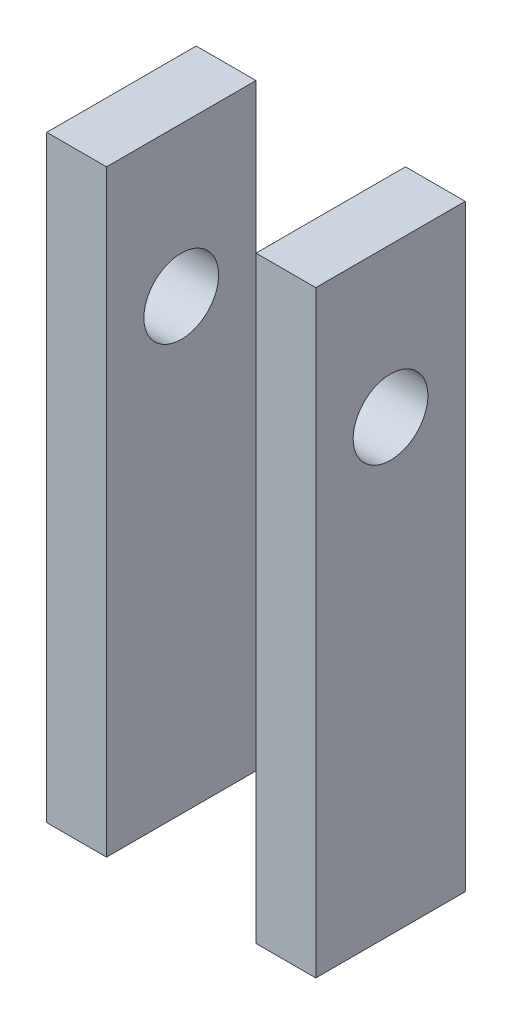
ISO-10303-21;
HEADER;
FILE_DESCRIPTION(('STEP AP214'),'2;1');
FILE_NAME('part.step','',(''),(''),'','','');
FILE_SCHEMA(('AUTOMOTIVE_DESIGN { 1 0 10303 214 1 1 1 1 }'));
ENDSEC;
DATA;
#1=APPLICATION_CONTEXT('core data for automotive mechanical design processes');
#2=APPLICATION_PROTOCOL_DEFINITION('international standard','automotive_design',2000,#1);
#3=PRODUCT_CONTEXT('',#1,'mechanical');
#4=PRODUCT('Part','Part','',(#3));
#5=PRODUCT_RELATED_PRODUCT_CATEGORY('part','',(#4));
#6=PRODUCT_DEFINITION_FORMATION('','',#4);
#7=PRODUCT_DEFINITION_CONTEXT('part definition',#1,'design');
#8=PRODUCT_DEFINITION('design','',#6,#7);
#9=PRODUCT_DEFINITION_SHAPE('','',#8);
#10=(LENGTH_UNIT() NAMED_UNIT(*) SI_UNIT(.MILLI.,.METRE.));
#11=(NAMED_UNIT(*) PLANE_ANGLE_UNIT() SI_UNIT($,.RADIAN.));
#12=(NAMED_UNIT(*) SI_UNIT($,.STERADIAN.) SOLID_ANGLE_UNIT());
#13=UNCERTAINTY_MEASURE_WITH_UNIT(LENGTH_MEASURE(1.E-05),#10,'distance_accuracy_value','');
#14=(GEOMETRIC_REPRESENTATION_CONTEXT(3) GLOBAL_UNCERTAINTY_ASSIGNED_CONTEXT((#13)) GLOBAL_UNIT_ASSIGNED_CONTEXT((#10,
#11,#12)) REPRESENTATION_CONTEXT('',''));
#15=CARTESIAN_POINT('',(0.,0.,0.));
#16=DIRECTION('',(0.,0.,1.));
#17=DIRECTION('',(1.,0.,0.));
#18=AXIS2_PLACEMENT_3D('',#15,#16,#17);
#19=CARTESIAN_POINT('',(6.35,50.8,0.));
#20=DIRECTION('',(-1.,0.,0.));
#21=DIRECTION('',(0.,0.,1.));
#22=AXIS2_PLACEMENT_3D('',#19,#20,#21);
#23=PLANE('',#22);
#24=CARTESIAN_POINT('',(6.35,38.1,0.));
#25=DIRECTION('',(-1.,0.,0.));
#26=DIRECTION('',(0.,0.,1.));
#27=AXIS2_PLACEMENT_3D('',#24,#25,#26);
#28=CIRCLE('',#27,3.175);
#29=CARTESIAN_POINT('',(6.35,38.1,3.175));
#30=VERTEX_POINT('',#29);
#31=EDGE_CURVE('E118',#30,#30,#28,.T.);
#32=ORIENTED_EDGE('',*,*,#31,.F.);
#33=EDGE_LOOP('',(#32));
#34=FACE_BOUND('',#33,.T.);
#35=DIRECTION('',(0.,0.,-1.));
#36=VECTOR('',#35,1.);
#37=CARTESIAN_POINT('',(6.35,0.,0.));
#38=LINE('',#37,#36);
#39=CARTESIAN_POINT('',(6.35,0.,6.35));
#40=VERTEX_POINT('',#39);
#41=CARTESIAN_POINT('',(6.35,0.,-6.35));
#42=VERTEX_POINT('',#41);
#43=EDGE_CURVE('E116',#40,#42,#38,.T.);
#44=ORIENTED_EDGE('',*,*,#43,.F.);
#45=DIRECTION('',(0.,-1.,0.));
#46=VECTOR('',#45,1.);
#47=CARTESIAN_POINT('',(6.35,50.8,6.35));
#48=LINE('',#47,#46);
#49=CARTESIAN_POINT('',(6.35,50.8,6.35));
#50=VERTEX_POINT('',#49);
#51=EDGE_CURVE('E12',#50,#40,#48,.T.);
#52=ORIENTED_EDGE('',*,*,#51,.F.);
#53=DIRECTION('',(0.,0.,-1.));
#54=VECTOR('',#53,1.);
#55=CARTESIAN_POINT('',(6.35,50.8,0.));
#56=LINE('',#55,#54);
#57=CARTESIAN_POINT('',(6.35,50.8,-6.35));
#58=VERTEX_POINT('',#57);
#59=EDGE_CURVE('E101',#50,#58,#56,.T.);
#60=ORIENTED_EDGE('',*,*,#59,.T.);
#61=DIRECTION('',(0.,-1.,0.));
#62=VECTOR('',#61,1.);
#63=CARTESIAN_POINT('',(6.35,50.8,-6.35));
#64=LINE('',#63,#62);
#65=EDGE_CURVE('E69',#58,#42,#64,.T.);
#66=ORIENTED_EDGE('',*,*,#65,.T.);
#67=EDGE_LOOP('',(#44,#52,#60,#66));
#68=FACE_BOUND('',#67,.T.);
#69=ADVANCED_FACE('F53',(#34,#68),#23,.T.);
#70=CARTESIAN_POINT('',(0.,50.8,6.35));
#71=DIRECTION('',(0.,0.,-1.));
#72=DIRECTION('',(-1.,0.,0.));
#73=AXIS2_PLACEMENT_3D('',#70,#71,#72);
#74=PLANE('',#73);
#75=DIRECTION('',(1.,0.,0.));
#76=VECTOR('',#75,1.);
#77=CARTESIAN_POINT('',(0.,0.,6.35));
#78=LINE('',#77,#76);
#79=CARTESIAN_POINT('',(11.43,0.,6.35));
#80=VERTEX_POINT('',#79);
#81=EDGE_CURVE('E107',#40,#80,#78,.T.);
#82=ORIENTED_EDGE('',*,*,#81,.T.);
#83=DIRECTION('',(0.,-1.,0.));
#84=VECTOR('',#83,1.);
#85=CARTESIAN_POINT('',(11.43,50.8,6.35));
#86=LINE('',#85,#84);
#87=CARTESIAN_POINT('',(11.43,50.8,6.35));
#88=VERTEX_POINT('',#87);
#89=EDGE_CURVE('E61',#88,#80,#86,.T.);
#90=ORIENTED_EDGE('',*,*,#89,.F.);
#91=DIRECTION('',(1.,0.,0.));
#92=VECTOR('',#91,1.);
#93=CARTESIAN_POINT('',(0.,50.8,6.35));
#94=LINE('',#93,#92);
#95=EDGE_CURVE('E95',#50,#88,#94,.T.);
#96=ORIENTED_EDGE('',*,*,#95,.F.);
#97=ORIENTED_EDGE('',*,*,#51,.T.);
#98=EDGE_LOOP('',(#82,#90,#96,#97));
#99=FACE_BOUND('',#98,.T.);
#100=ADVANCED_FACE('F105',(#99),#74,.F.);
#101=CARTESIAN_POINT('',(11.43,50.8,0.));
#102=DIRECTION('',(-1.,0.,0.));
#103=DIRECTION('',(0.,0.,1.));
#104=AXIS2_PLACEMENT_3D('',#101,#102,#103);
#105=PLANE('',#104);
#106=CARTESIAN_POINT('',(11.43,38.1,0.));
#107=DIRECTION('',(-1.,0.,0.));
#108=DIRECTION('',(0.,0.,1.));
#109=AXIS2_PLACEMENT_3D('',#106,#107,#108);
#110=CIRCLE('',#109,3.175);
#111=CARTESIAN_POINT('',(11.43,38.1,3.175));
#112=VERTEX_POINT('',#111);
#113=EDGE_CURVE('E130',#112,#112,#110,.T.);
#114=ORIENTED_EDGE('',*,*,#113,.T.);
#115=EDGE_LOOP('',(#114));
#116=FACE_BOUND('',#115,.T.);
#117=DIRECTION('',(0.,0.,-1.));
#118=VECTOR('',#117,1.);
#119=CARTESIAN_POINT('',(11.43,0.,0.));
#120=LINE('',#119,#118);
#121=CARTESIAN_POINT('',(11.43,0.,-6.35));
#122=VERTEX_POINT('',#121);
#123=EDGE_CURVE('E120',#80,#122,#120,.T.);
#124=ORIENTED_EDGE('',*,*,#123,.T.);
#125=DIRECTION('',(0.,-1.,0.));
#126=VECTOR('',#125,1.);
#127=CARTESIAN_POINT('',(11.43,50.8,-6.35));
#128=LINE('',#127,#126);
#129=CARTESIAN_POINT('',(11.43,50.8,-6.35));
#130=VERTEX_POINT('',#129);
#131=EDGE_CURVE('E83',#130,#122,#128,.T.);
#132=ORIENTED_EDGE('',*,*,#131,.F.);
#133=DIRECTION('',(0.,0.,-1.));
#134=VECTOR('',#133,1.);
#135=CARTESIAN_POINT('',(11.43,50.8,0.));
#136=LINE('',#135,#134);
#137=EDGE_CURVE('E100',#88,#130,#136,.T.);
#138=ORIENTED_EDGE('',*,*,#137,.F.);
#139=ORIENTED_EDGE('',*,*,#89,.T.);
#140=EDGE_LOOP('',(#124,#132,#138,#139));
#141=FACE_BOUND('',#140,.T.);
#142=ADVANCED_FACE('F110',(#116,#141),#105,.F.);
#143=CARTESIAN_POINT('',(0.,50.8,-6.35));
#144=DIRECTION('',(0.,0.,-1.));
#145=DIRECTION('',(-1.,0.,0.));
#146=AXIS2_PLACEMENT_3D('',#143,#144,#145);
#147=PLANE('',#146);
#148=DIRECTION('',(1.,0.,0.));
#149=VECTOR('',#148,1.);
#150=CARTESIAN_POINT('',(0.,0.,-6.35));
#151=LINE('',#150,#149);
#152=EDGE_CURVE('E122',#42,#122,#151,.T.);
#153=ORIENTED_EDGE('',*,*,#152,.F.);
#154=ORIENTED_EDGE('',*,*,#65,.F.);
#155=DIRECTION('',(1.,0.,0.));
#156=VECTOR('',#155,1.);
#157=CARTESIAN_POINT('',(0.,50.8,-6.35));
#158=LINE('',#157,#156);
#159=EDGE_CURVE('E111',#58,#130,#158,.T.);
#160=ORIENTED_EDGE('',*,*,#159,.T.);
#161=ORIENTED_EDGE('',*,*,#131,.T.);
#162=EDGE_LOOP('',(#153,#154,#160,#161));
#163=FACE_BOUND('',#162,.T.);
#164=ADVANCED_FACE('F151',(#163),#147,.T.);
#165=CARTESIAN_POINT('',(0.,50.8,0.));
#166=DIRECTION('',(0.,1.,0.));
#167=DIRECTION('',(0.,0.,1.));
#168=AXIS2_PLACEMENT_3D('',#165,#166,#167);
#169=PLANE('',#168);
#170=ORIENTED_EDGE('',*,*,#59,.F.);
#171=ORIENTED_EDGE('',*,*,#95,.T.);
#172=ORIENTED_EDGE('',*,*,#137,.T.);
#173=ORIENTED_EDGE('',*,*,#159,.F.);
#174=EDGE_LOOP('',(#170,#171,#172,#173));
#175=FACE_BOUND('',#174,.T.);
#176=ADVANCED_FACE('F97',(#175),#169,.T.);
#177=CARTESIAN_POINT('',(0.,0.,0.));
#178=DIRECTION('',(0.,1.,0.));
#179=DIRECTION('',(0.,0.,1.));
#180=AXIS2_PLACEMENT_3D('',#177,#178,#179);
#181=PLANE('',#180);
#182=ORIENTED_EDGE('',*,*,#43,.T.);
#183=ORIENTED_EDGE('',*,*,#152,.T.);
#184=ORIENTED_EDGE('',*,*,#123,.F.);
#185=ORIENTED_EDGE('',*,*,#81,.F.);
#186=EDGE_LOOP('',(#182,#183,#184,#185));
#187=FACE_BOUND('',#186,.T.);
#188=ADVANCED_FACE('F137',(#187),#181,.F.);
#189=CARTESIAN_POINT('',(11.43,38.1,0.));
#190=DIRECTION('',(-1.,0.,0.));
#191=DIRECTION('',(0.,0.,1.));
#192=AXIS2_PLACEMENT_3D('',#189,#190,#191);
#193=CYLINDRICAL_SURFACE('',#192,3.175);
#194=ORIENTED_EDGE('',*,*,#31,.T.);
#195=EDGE_LOOP('',(#194));
#196=FACE_BOUND('',#195,.T.);
#197=ORIENTED_EDGE('',*,*,#113,.F.);
#198=EDGE_LOOP('',(#197));
#199=FACE_BOUND('',#198,.T.);
#200=ADVANCED_FACE('F135',(#196,#199),#193,.F.);
#201=CLOSED_SHELL('',(#69,#100,#142,#164,#176,#188,#200));
#202=MANIFOLD_SOLID_BREP('B2',#201);
#203=CARTESIAN_POINT('',(0.,50.8,6.35));
#204=DIRECTION('',(0.,0.,-1.));
#205=DIRECTION('',(-1.,0.,0.));
#206=AXIS2_PLACEMENT_3D('',#203,#204,#205);
#207=PLANE('',#206);
#208=DIRECTION('',(1.,0.,0.));
#209=VECTOR('',#208,1.);
#210=CARTESIAN_POINT('',(0.,0.,6.35));
#211=LINE('',#210,#209);
#212=CARTESIAN_POINT('',(-11.43,0.,6.35));
#213=VERTEX_POINT('',#212);
#214=CARTESIAN_POINT('',(-6.35,0.,6.35));
#215=VERTEX_POINT('',#214);
#216=EDGE_CURVE('E280',#213,#215,#211,.T.);
#217=ORIENTED_EDGE('',*,*,#216,.T.);
#218=DIRECTION('',(0.,-1.,0.));
#219=VECTOR('',#218,1.);
#220=CARTESIAN_POINT('',(-6.35,50.8,6.35));
#221=LINE('',#220,#219);
#222=CARTESIAN_POINT('',(-6.35,50.8,6.35));
#223=VERTEX_POINT('',#222);
#224=EDGE_CURVE('E51',#223,#215,#221,.T.);
#225=ORIENTED_EDGE('',*,*,#224,.F.);
#226=DIRECTION('',(1.,0.,0.));
#227=VECTOR('',#226,1.);
#228=CARTESIAN_POINT('',(0.,50.8,6.35));
#229=LINE('',#228,#227);
#230=CARTESIAN_POINT('',(-11.43,50.8,6.35));
#231=VERTEX_POINT('',#230);
#232=EDGE_CURVE('E262',#231,#223,#229,.T.);
#233=ORIENTED_EDGE('',*,*,#232,.F.);
#234=DIRECTION('',(0.,-1.,0.));
#235=VECTOR('',#234,1.);
#236=CARTESIAN_POINT('',(-11.43,50.8,6.35));
#237=LINE('',#236,#235);
#238=EDGE_CURVE('E229',#231,#213,#237,.T.);
#239=ORIENTED_EDGE('',*,*,#238,.T.);
#240=EDGE_LOOP('',(#217,#225,#233,#239));
#241=FACE_BOUND('',#240,.T.);
#242=ADVANCED_FACE('F212',(#241),#207,.F.);
#243=CARTESIAN_POINT('',(-6.35,50.8,0.));
#244=DIRECTION('',(-1.,0.,0.));
#245=DIRECTION('',(0.,0.,1.));
#246=AXIS2_PLACEMENT_3D('',#243,#244,#245);
#247=PLANE('',#246);
#248=CARTESIAN_POINT('',(-6.35,38.1,0.));
#249=DIRECTION('',(-1.,0.,0.));
#250=DIRECTION('',(0.,0.,1.));
#251=AXIS2_PLACEMENT_3D('',#248,#249,#250);
#252=CIRCLE('',#251,3.175);
#253=CARTESIAN_POINT('',(-6.35,38.1,3.175));
#254=VERTEX_POINT('',#253);
#255=EDGE_CURVE('E283',#254,#254,#252,.T.);
#256=ORIENTED_EDGE('',*,*,#255,.T.);
#257=EDGE_LOOP('',(#256));
#258=FACE_BOUND('',#257,.T.);
#259=DIRECTION('',(0.,0.,-1.));
#260=VECTOR('',#259,1.);
#261=CARTESIAN_POINT('',(-6.35,0.,0.));
#262=LINE('',#261,#260);
#263=CARTESIAN_POINT('',(-6.35,0.,-6.35));
#264=VERTEX_POINT('',#263);
#265=EDGE_CURVE('E268',#215,#264,#262,.T.);
#266=ORIENTED_EDGE('',*,*,#265,.T.);
#267=DIRECTION('',(0.,-1.,0.));
#268=VECTOR('',#267,1.);
#269=CARTESIAN_POINT('',(-6.35,50.8,-6.35));
#270=LINE('',#269,#268);
#271=CARTESIAN_POINT('',(-6.35,50.8,-6.35));
#272=VERTEX_POINT('',#271);
#273=EDGE_CURVE('E221',#272,#264,#270,.T.);
#274=ORIENTED_EDGE('',*,*,#273,.F.);
#275=DIRECTION('',(0.,0.,-1.));
#276=VECTOR('',#275,1.);
#277=CARTESIAN_POINT('',(-6.35,50.8,0.));
#278=LINE('',#277,#276);
#279=EDGE_CURVE('E254',#223,#272,#278,.T.);
#280=ORIENTED_EDGE('',*,*,#279,.F.);
#281=ORIENTED_EDGE('',*,*,#224,.T.);
#282=EDGE_LOOP('',(#266,#274,#280,#281));
#283=FACE_BOUND('',#282,.T.);
#284=ADVANCED_FACE('F267',(#258,#283),#247,.F.);
#285=CARTESIAN_POINT('',(0.,50.8,-6.35));
#286=DIRECTION('',(0.,0.,-1.));
#287=DIRECTION('',(-1.,0.,0.));
#288=AXIS2_PLACEMENT_3D('',#285,#286,#287);
#289=PLANE('',#288);
#290=DIRECTION('',(1.,0.,0.));
#291=VECTOR('',#290,1.);
#292=CARTESIAN_POINT('',(0.,0.,-6.35));
#293=LINE('',#292,#291);
#294=CARTESIAN_POINT('',(-11.43,0.,-6.35));
#295=VERTEX_POINT('',#294);
#296=EDGE_CURVE('E286',#295,#264,#293,.T.);
#297=ORIENTED_EDGE('',*,*,#296,.F.);
#298=DIRECTION('',(0.,-1.,0.));
#299=VECTOR('',#298,1.);
#300=CARTESIAN_POINT('',(-11.43,50.8,-6.35));
#301=LINE('',#300,#299);
#302=CARTESIAN_POINT('',(-11.43,50.8,-6.35));
#303=VERTEX_POINT('',#302);
#304=EDGE_CURVE('E243',#303,#295,#301,.T.);
#305=ORIENTED_EDGE('',*,*,#304,.F.);
#306=DIRECTION('',(1.,0.,0.));
#307=VECTOR('',#306,1.);
#308=CARTESIAN_POINT('',(0.,50.8,-6.35));
#309=LINE('',#308,#307);
#310=EDGE_CURVE('E261',#303,#272,#309,.T.);
#311=ORIENTED_EDGE('',*,*,#310,.T.);
#312=ORIENTED_EDGE('',*,*,#273,.T.);
#313=EDGE_LOOP('',(#297,#305,#311,#312));
#314=FACE_BOUND('',#313,.T.);
#315=ADVANCED_FACE('F272',(#314),#289,.T.);
#316=CARTESIAN_POINT('',(-11.43,50.8,0.));
#317=DIRECTION('',(-1.,0.,0.));
#318=DIRECTION('',(0.,0.,1.));
#319=AXIS2_PLACEMENT_3D('',#316,#317,#318);
#320=PLANE('',#319);
#321=CARTESIAN_POINT('',(-11.43,38.1,0.));
#322=DIRECTION('',(-1.,0.,0.));
#323=DIRECTION('',(0.,0.,1.));
#324=AXIS2_PLACEMENT_3D('',#321,#322,#323);
#325=CIRCLE('',#324,3.175);
#326=CARTESIAN_POINT('',(-11.43,38.1,3.175));
#327=VERTEX_POINT('',#326);
#328=EDGE_CURVE('E302',#327,#327,#325,.T.);
#329=ORIENTED_EDGE('',*,*,#328,.F.);
#330=EDGE_LOOP('',(#329));
#331=FACE_BOUND('',#330,.T.);
#332=DIRECTION('',(0.,0.,-1.));
#333=VECTOR('',#332,1.);
#334=CARTESIAN_POINT('',(-11.43,0.,0.));
#335=LINE('',#334,#333);
#336=EDGE_CURVE('E289',#213,#295,#335,.T.);
#337=ORIENTED_EDGE('',*,*,#336,.F.);
#338=ORIENTED_EDGE('',*,*,#238,.F.);
#339=DIRECTION('',(0.,0.,-1.));
#340=VECTOR('',#339,1.);
#341=CARTESIAN_POINT('',(-11.43,50.8,0.));
#342=LINE('',#341,#340);
#343=EDGE_CURVE('E274',#231,#303,#342,.T.);
#344=ORIENTED_EDGE('',*,*,#343,.T.);
#345=ORIENTED_EDGE('',*,*,#304,.T.);
#346=EDGE_LOOP('',(#337,#338,#344,#345));
#347=FACE_BOUND('',#346,.T.);
#348=ADVANCED_FACE('F310',(#331,#347),#320,.T.);
#349=CARTESIAN_POINT('',(0.,50.8,0.));
#350=DIRECTION('',(0.,1.,0.));
#351=DIRECTION('',(0.,0.,1.));
#352=AXIS2_PLACEMENT_3D('',#349,#350,#351);
#353=PLANE('',#352);
#354=ORIENTED_EDGE('',*,*,#232,.T.);
#355=ORIENTED_EDGE('',*,*,#279,.T.);
#356=ORIENTED_EDGE('',*,*,#310,.F.);
#357=ORIENTED_EDGE('',*,*,#343,.F.);
#358=EDGE_LOOP('',(#354,#355,#356,#357));
#359=FACE_BOUND('',#358,.T.);
#360=ADVANCED_FACE('F258',(#359),#353,.T.);
#361=CARTESIAN_POINT('',(0.,0.,0.));
#362=DIRECTION('',(0.,1.,0.));
#363=DIRECTION('',(0.,0.,1.));
#364=AXIS2_PLACEMENT_3D('',#361,#362,#363);
#365=PLANE('',#364);
#366=ORIENTED_EDGE('',*,*,#216,.F.);
#367=ORIENTED_EDGE('',*,*,#336,.T.);
#368=ORIENTED_EDGE('',*,*,#296,.T.);
#369=ORIENTED_EDGE('',*,*,#265,.F.);
#370=EDGE_LOOP('',(#366,#367,#368,#369));
#371=FACE_BOUND('',#370,.T.);
#372=ADVANCED_FACE('F317',(#371),#365,.F.);
#373=CARTESIAN_POINT('',(11.43,38.1,0.));
#374=DIRECTION('',(-1.,0.,0.));
#375=DIRECTION('',(0.,0.,1.));
#376=AXIS2_PLACEMENT_3D('',#373,#374,#375);
#377=CYLINDRICAL_SURFACE('',#376,3.175);
#378=ORIENTED_EDGE('',*,*,#328,.T.);
#379=EDGE_LOOP('',(#378));
#380=FACE_BOUND('',#379,.T.);
#381=ORIENTED_EDGE('',*,*,#255,.F.);
#382=EDGE_LOOP('',(#381));
#383=FACE_BOUND('',#382,.T.);
#384=ADVANCED_FACE('F307',(#380,#383),#377,.F.);
#385=CLOSED_SHELL('',(#242,#284,#315,#348,#360,#372,#384));
#386=MANIFOLD_SOLID_BREP('B6',#385);
#387=ADVANCED_BREP_SHAPE_REPRESENTATION('',(#18,#202,#386),#14);
#388=SHAPE_DEFINITION_REPRESENTATION(#9,#387);
ENDSEC;
END-ISO-10303-21;
